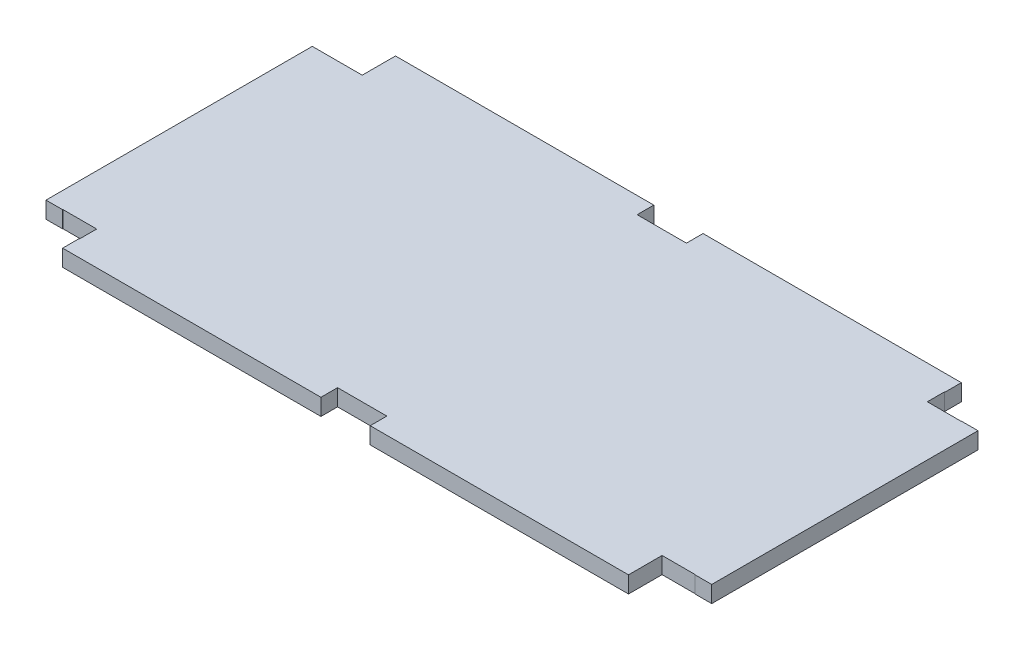
ISO-10303-21;
HEADER;
FILE_DESCRIPTION(('STEP AP214'),'2;1');
FILE_NAME('part.step','',(''),(''),'','','');
FILE_SCHEMA(('AUTOMOTIVE_DESIGN { 1 0 10303 214 1 1 1 1 }'));
ENDSEC;
DATA;
#1=APPLICATION_CONTEXT('core data for automotive mechanical design processes');
#2=APPLICATION_PROTOCOL_DEFINITION('international standard','automotive_design',2000,#1);
#3=PRODUCT_CONTEXT('',#1,'mechanical');
#4=PRODUCT('Part','Part','',(#3));
#5=PRODUCT_RELATED_PRODUCT_CATEGORY('part','',(#4));
#6=PRODUCT_DEFINITION_FORMATION('','',#4);
#7=PRODUCT_DEFINITION_CONTEXT('part definition',#1,'design');
#8=PRODUCT_DEFINITION('design','',#6,#7);
#9=PRODUCT_DEFINITION_SHAPE('','',#8);
#10=(LENGTH_UNIT() NAMED_UNIT(*) SI_UNIT(.MILLI.,.METRE.));
#11=(NAMED_UNIT(*) PLANE_ANGLE_UNIT() SI_UNIT($,.RADIAN.));
#12=(NAMED_UNIT(*) SI_UNIT($,.STERADIAN.) SOLID_ANGLE_UNIT());
#13=UNCERTAINTY_MEASURE_WITH_UNIT(LENGTH_MEASURE(1.E-05),#10,'distance_accuracy_value','');
#14=(GEOMETRIC_REPRESENTATION_CONTEXT(3) GLOBAL_UNCERTAINTY_ASSIGNED_CONTEXT((#13)) GLOBAL_UNIT_ASSIGNED_CONTEXT((#10,
#11,#12)) REPRESENTATION_CONTEXT('',''));
#15=CARTESIAN_POINT('',(0.,0.,0.));
#16=DIRECTION('',(0.,0.,1.));
#17=DIRECTION('',(1.,0.,0.));
#18=AXIS2_PLACEMENT_3D('',#15,#16,#17);
#19=CARTESIAN_POINT('',(0.,6.35,0.));
#20=DIRECTION('',(0.,1.,0.));
#21=DIRECTION('',(0.,0.,1.));
#22=AXIS2_PLACEMENT_3D('',#19,#20,#21);
#23=PLANE('',#22);
#24=DIRECTION('',(-1.,0.,0.));
#25=VECTOR('',#24,1.);
#26=CARTESIAN_POINT('',(127.,6.35,-50.8));
#27=LINE('',#26,#25);
#28=CARTESIAN_POINT('',(127.,6.35,-50.8));
#29=VERTEX_POINT('',#28);
#30=CARTESIAN_POINT('',(120.65,6.35,-50.8));
#31=VERTEX_POINT('',#30);
#32=EDGE_CURVE('E381',#29,#31,#27,.T.);
#33=ORIENTED_EDGE('',*,*,#32,.T.);
#34=DIRECTION('',(0.,0.,1.));
#35=VECTOR('',#34,1.);
#36=CARTESIAN_POINT('',(120.65,6.35,0.));
#37=LINE('',#36,#35);
#38=CARTESIAN_POINT('',(120.65,6.34999999999999,-50.6901986028892));
#39=VERTEX_POINT('',#38);
#40=EDGE_CURVE('E247',#31,#39,#37,.T.);
#41=ORIENTED_EDGE('',*,*,#40,.T.);
#42=DIRECTION('',(-1.,0.,0.));
#43=VECTOR('',#42,1.);
#44=CARTESIAN_POINT('',(0.,6.35,-50.6901986028892));
#45=LINE('',#44,#43);
#46=CARTESIAN_POINT('',(107.773755588125,6.34999999999999,-50.6901986028892));
#47=VERTEX_POINT('',#46);
#48=EDGE_CURVE('E254',#39,#47,#45,.T.);
#49=ORIENTED_EDGE('',*,*,#48,.T.);
#50=DIRECTION('',(0.,0.,-1.));
#51=VECTOR('',#50,1.);
#52=CARTESIAN_POINT('',(107.773755588125,6.35,0.));
#53=LINE('',#52,#51);
#54=CARTESIAN_POINT('',(107.773755588125,6.34999999999999,-57.15));
#55=VERTEX_POINT('',#54);
#56=EDGE_CURVE('E542',#47,#55,#53,.T.);
#57=ORIENTED_EDGE('',*,*,#56,.T.);
#58=DIRECTION('',(1.,0.,0.));
#59=VECTOR('',#58,1.);
#60=CARTESIAN_POINT('',(0.,6.35,-57.15));
#61=LINE('',#60,#59);
#62=CARTESIAN_POINT('',(107.95,6.35,-57.15));
#63=VERTEX_POINT('',#62);
#64=EDGE_CURVE('E546',#55,#63,#61,.T.);
#65=ORIENTED_EDGE('',*,*,#64,.T.);
#66=DIRECTION('',(0.,0.,1.));
#67=VECTOR('',#66,1.);
#68=CARTESIAN_POINT('',(107.95,6.35,-63.5));
#69=LINE('',#68,#67);
#70=CARTESIAN_POINT('',(107.95,6.35,-63.5));
#71=VERTEX_POINT('',#70);
#72=EDGE_CURVE('E376',#71,#63,#69,.T.);
#73=ORIENTED_EDGE('',*,*,#72,.F.);
#74=DIRECTION('',(-1.,0.,0.));
#75=VECTOR('',#74,1.);
#76=CARTESIAN_POINT('',(127.,6.35,-63.5));
#77=LINE('',#76,#75);
#78=CARTESIAN_POINT('',(9.39799999999999,6.35,-63.5));
#79=VERTEX_POINT('',#78);
#80=EDGE_CURVE('E325',#71,#79,#77,.T.);
#81=ORIENTED_EDGE('',*,*,#80,.T.);
#82=DIRECTION('',(0.,0.,1.));
#83=VECTOR('',#82,1.);
#84=CARTESIAN_POINT('',(9.39799999999999,6.35,-63.5));
#85=LINE('',#84,#83);
#86=CARTESIAN_POINT('',(9.39799999999999,6.35,-57.15));
#87=VERTEX_POINT('',#86);
#88=EDGE_CURVE('E406',#79,#87,#85,.T.);
#89=ORIENTED_EDGE('',*,*,#88,.T.);
#90=DIRECTION('',(1.,0.,0.));
#91=VECTOR('',#90,1.);
#92=CARTESIAN_POINT('',(-9.39799999999999,6.35,-57.15));
#93=LINE('',#92,#91);
#94=CARTESIAN_POINT('',(-9.39799999999999,6.35,-57.15));
#95=VERTEX_POINT('',#94);
#96=EDGE_CURVE('E403',#95,#87,#93,.T.);
#97=ORIENTED_EDGE('',*,*,#96,.F.);
#98=DIRECTION('',(0.,0.,1.));
#99=VECTOR('',#98,1.);
#100=CARTESIAN_POINT('',(-9.39799999999999,6.35,-63.5));
#101=LINE('',#100,#99);
#102=CARTESIAN_POINT('',(-9.39799999999999,6.35,-63.5));
#103=VERTEX_POINT('',#102);
#104=EDGE_CURVE('E399',#103,#95,#101,.T.);
#105=ORIENTED_EDGE('',*,*,#104,.F.);
#106=CARTESIAN_POINT('',(-107.95,6.35,-63.5));
#107=VERTEX_POINT('',#106);
#108=EDGE_CURVE('E345',#103,#107,#77,.T.);
#109=ORIENTED_EDGE('',*,*,#108,.T.);
#110=DIRECTION('',(0.,0.,1.));
#111=VECTOR('',#110,1.);
#112=CARTESIAN_POINT('',(-107.95,6.35,-63.5));
#113=LINE('',#112,#111);
#114=CARTESIAN_POINT('',(-107.95,6.34999999999999,-50.8));
#115=VERTEX_POINT('',#114);
#116=EDGE_CURVE('E371',#107,#115,#113,.T.);
#117=ORIENTED_EDGE('',*,*,#116,.T.);
#118=DIRECTION('',(1.,0.,0.));
#119=VECTOR('',#118,1.);
#120=CARTESIAN_POINT('',(-127.,6.35,-50.8));
#121=LINE('',#120,#119);
#122=CARTESIAN_POINT('',(-127.,6.35,-50.8));
#123=VERTEX_POINT('',#122);
#124=EDGE_CURVE('E365',#123,#115,#121,.T.);
#125=ORIENTED_EDGE('',*,*,#124,.F.);
#126=DIRECTION('',(0.,0.,1.));
#127=VECTOR('',#126,1.);
#128=CARTESIAN_POINT('',(-127.,6.35,63.5));
#129=LINE('',#128,#127);
#130=CARTESIAN_POINT('',(-127.,6.35,50.8));
#131=VERTEX_POINT('',#130);
#132=EDGE_CURVE('E358',#123,#131,#129,.T.);
#133=ORIENTED_EDGE('',*,*,#132,.T.);
#134=DIRECTION('',(1.,0.,0.));
#135=VECTOR('',#134,1.);
#136=CARTESIAN_POINT('',(-127.,6.35,50.8));
#137=LINE('',#136,#135);
#138=CARTESIAN_POINT('',(-120.65,6.35,50.8));
#139=VERTEX_POINT('',#138);
#140=EDGE_CURVE('E451',#131,#139,#137,.T.);
#141=ORIENTED_EDGE('',*,*,#140,.T.);
#142=DIRECTION('',(0.,0.,1.));
#143=VECTOR('',#142,1.);
#144=CARTESIAN_POINT('',(-120.65,6.35,0.));
#145=LINE('',#144,#143);
#146=CARTESIAN_POINT('',(-120.65,6.34999999999999,50.6901986028892));
#147=VERTEX_POINT('',#146);
#148=EDGE_CURVE('E509',#147,#139,#145,.T.);
#149=ORIENTED_EDGE('',*,*,#148,.F.);
#150=DIRECTION('',(-1.,0.,0.));
#151=VECTOR('',#150,1.);
#152=CARTESIAN_POINT('',(0.,6.35,50.6901986028892));
#153=LINE('',#152,#151);
#154=CARTESIAN_POINT('',(-107.773755588125,6.34999999999999,50.6901986028892));
#155=VERTEX_POINT('',#154);
#156=EDGE_CURVE('E488',#155,#147,#153,.T.);
#157=ORIENTED_EDGE('',*,*,#156,.F.);
#158=DIRECTION('',(0.,0.,1.));
#159=VECTOR('',#158,1.);
#160=CARTESIAN_POINT('',(-107.773755588125,6.35,0.));
#161=LINE('',#160,#159);
#162=CARTESIAN_POINT('',(-107.773755588125,6.34999999999999,57.15));
#163=VERTEX_POINT('',#162);
#164=EDGE_CURVE('E491',#155,#163,#161,.T.);
#165=ORIENTED_EDGE('',*,*,#164,.T.);
#166=DIRECTION('',(-1.,0.,0.));
#167=VECTOR('',#166,1.);
#168=CARTESIAN_POINT('',(0.,6.35,57.15));
#169=LINE('',#168,#167);
#170=CARTESIAN_POINT('',(-107.95,6.35,57.15));
#171=VERTEX_POINT('',#170);
#172=EDGE_CURVE('E502',#163,#171,#169,.T.);
#173=ORIENTED_EDGE('',*,*,#172,.T.);
#174=DIRECTION('',(0.,0.,-1.));
#175=VECTOR('',#174,1.);
#176=CARTESIAN_POINT('',(-107.95,6.35,63.5));
#177=LINE('',#176,#175);
#178=CARTESIAN_POINT('',(-107.95,6.35,63.5));
#179=VERTEX_POINT('',#178);
#180=EDGE_CURVE('E375',#179,#171,#177,.T.);
#181=ORIENTED_EDGE('',*,*,#180,.F.);
#182=DIRECTION('',(1.,0.,0.));
#183=VECTOR('',#182,1.);
#184=CARTESIAN_POINT('',(127.,6.35,63.5));
#185=LINE('',#184,#183);
#186=CARTESIAN_POINT('',(-9.39799999999999,6.35,63.5));
#187=VERTEX_POINT('',#186);
#188=EDGE_CURVE('E353',#179,#187,#185,.T.);
#189=ORIENTED_EDGE('',*,*,#188,.T.);
#190=DIRECTION('',(0.,0.,-1.));
#191=VECTOR('',#190,1.);
#192=CARTESIAN_POINT('',(-9.39799999999999,6.35,63.5));
#193=LINE('',#192,#191);
#194=CARTESIAN_POINT('',(-9.39799999999999,6.35,57.15));
#195=VERTEX_POINT('',#194);
#196=EDGE_CURVE('E424',#187,#195,#193,.T.);
#197=ORIENTED_EDGE('',*,*,#196,.T.);
#198=DIRECTION('',(1.,0.,0.));
#199=VECTOR('',#198,1.);
#200=CARTESIAN_POINT('',(-9.39799999999999,6.35,57.15));
#201=LINE('',#200,#199);
#202=CARTESIAN_POINT('',(9.39799999999999,6.35,57.15));
#203=VERTEX_POINT('',#202);
#204=EDGE_CURVE('E429',#195,#203,#201,.T.);
#205=ORIENTED_EDGE('',*,*,#204,.T.);
#206=DIRECTION('',(0.,0.,-1.));
#207=VECTOR('',#206,1.);
#208=CARTESIAN_POINT('',(9.39799999999999,6.35,63.5));
#209=LINE('',#208,#207);
#210=CARTESIAN_POINT('',(9.39799999999999,6.35,63.5));
#211=VERTEX_POINT('',#210);
#212=EDGE_CURVE('E433',#211,#203,#209,.T.);
#213=ORIENTED_EDGE('',*,*,#212,.F.);
#214=CARTESIAN_POINT('',(107.95,6.35,63.5));
#215=VERTEX_POINT('',#214);
#216=EDGE_CURVE('E354',#211,#215,#185,.T.);
#217=ORIENTED_EDGE('',*,*,#216,.T.);
#218=DIRECTION('',(0.,0.,-1.));
#219=VECTOR('',#218,1.);
#220=CARTESIAN_POINT('',(107.95,6.35,63.5));
#221=LINE('',#220,#219);
#222=CARTESIAN_POINT('',(107.95,6.34999999999999,50.6901986028892));
#223=VERTEX_POINT('',#222);
#224=EDGE_CURVE('E471',#215,#223,#221,.T.);
#225=ORIENTED_EDGE('',*,*,#224,.T.);
#226=DIRECTION('',(1.,0.,0.));
#227=VECTOR('',#226,1.);
#228=CARTESIAN_POINT('',(0.,6.35,50.6901986028892));
#229=LINE('',#228,#227);
#230=CARTESIAN_POINT('',(120.65,6.34999999999999,50.6901986028892));
#231=VERTEX_POINT('',#230);
#232=EDGE_CURVE('E484',#223,#231,#229,.T.);
#233=ORIENTED_EDGE('',*,*,#232,.T.);
#234=DIRECTION('',(0.,0.,1.));
#235=VECTOR('',#234,1.);
#236=CARTESIAN_POINT('',(120.65,6.35,0.));
#237=LINE('',#236,#235);
#238=CARTESIAN_POINT('',(120.65,6.35,50.8));
#239=VERTEX_POINT('',#238);
#240=EDGE_CURVE('E495',#231,#239,#237,.T.);
#241=ORIENTED_EDGE('',*,*,#240,.T.);
#242=DIRECTION('',(-1.,0.,0.));
#243=VECTOR('',#242,1.);
#244=CARTESIAN_POINT('',(127.,6.35,50.8));
#245=LINE('',#244,#243);
#246=CARTESIAN_POINT('',(127.,6.35,50.8));
#247=VERTEX_POINT('',#246);
#248=EDGE_CURVE('E398',#247,#239,#245,.T.);
#249=ORIENTED_EDGE('',*,*,#248,.F.);
#250=DIRECTION('',(0.,0.,-1.));
#251=VECTOR('',#250,1.);
#252=CARTESIAN_POINT('',(127.,6.35,63.5));
#253=LINE('',#252,#251);
#254=EDGE_CURVE('E349',#247,#29,#253,.T.);
#255=ORIENTED_EDGE('',*,*,#254,.T.);
#256=EDGE_LOOP('',(#33,#41,#49,#57,#65,#73,#81,#89,#97,#105,#109,#117,#125,#133,#141,#149,#157,
#165,#173,#181,#189,#197,#205,#213,#217,#225,#233,#241,#249,#255));
#257=FACE_BOUND('',#256,.T.);
#258=ADVANCED_FACE('F38',(#257),#23,.T.);
#259=CARTESIAN_POINT('',(0.,0.,0.));
#260=DIRECTION('',(0.,1.,0.));
#261=DIRECTION('',(0.,0.,1.));
#262=AXIS2_PLACEMENT_3D('',#259,#260,#261);
#263=PLANE('',#262);
#264=DIRECTION('',(0.,0.,1.));
#265=VECTOR('',#264,1.);
#266=CARTESIAN_POINT('',(120.65,0.,0.));
#267=LINE('',#266,#265);
#268=CARTESIAN_POINT('',(120.65,0.,-50.8));
#269=VERTEX_POINT('',#268);
#270=CARTESIAN_POINT('',(120.65,0.,-50.6901986028892));
#271=VERTEX_POINT('',#270);
#272=EDGE_CURVE('E235',#269,#271,#267,.T.);
#273=ORIENTED_EDGE('',*,*,#272,.F.);
#274=DIRECTION('',(1.,0.,0.));
#275=VECTOR('',#274,1.);
#276=CARTESIAN_POINT('',(0.,0.,-50.8));
#277=LINE('',#276,#275);
#278=CARTESIAN_POINT('',(127.,0.,-50.8));
#279=VERTEX_POINT('',#278);
#280=EDGE_CURVE('E309',#269,#279,#277,.T.);
#281=ORIENTED_EDGE('',*,*,#280,.T.);
#282=DIRECTION('',(0.,0.,-1.));
#283=VECTOR('',#282,1.);
#284=CARTESIAN_POINT('',(127.,0.,63.5));
#285=LINE('',#284,#283);
#286=CARTESIAN_POINT('',(127.,0.,50.8));
#287=VERTEX_POINT('',#286);
#288=EDGE_CURVE('E331',#287,#279,#285,.T.);
#289=ORIENTED_EDGE('',*,*,#288,.F.);
#290=DIRECTION('',(1.,0.,0.));
#291=VECTOR('',#290,1.);
#292=CARTESIAN_POINT('',(0.,0.,50.8));
#293=LINE('',#292,#291);
#294=CARTESIAN_POINT('',(120.65,0.,50.8));
#295=VERTEX_POINT('',#294);
#296=EDGE_CURVE('E312',#295,#287,#293,.T.);
#297=ORIENTED_EDGE('',*,*,#296,.F.);
#298=DIRECTION('',(0.,0.,1.));
#299=VECTOR('',#298,1.);
#300=CARTESIAN_POINT('',(120.65,0.,0.));
#301=LINE('',#300,#299);
#302=CARTESIAN_POINT('',(120.65,0.,50.6901986028892));
#303=VERTEX_POINT('',#302);
#304=EDGE_CURVE('E499',#303,#295,#301,.T.);
#305=ORIENTED_EDGE('',*,*,#304,.F.);
#306=DIRECTION('',(1.,0.,0.));
#307=VECTOR('',#306,1.);
#308=CARTESIAN_POINT('',(0.,0.,50.6901986028892));
#309=LINE('',#308,#307);
#310=CARTESIAN_POINT('',(107.95,0.,50.6901986028892));
#311=VERTEX_POINT('',#310);
#312=EDGE_CURVE('E267',#311,#303,#309,.T.);
#313=ORIENTED_EDGE('',*,*,#312,.F.);
#314=DIRECTION('',(0.,0.,1.));
#315=VECTOR('',#314,1.);
#316=CARTESIAN_POINT('',(107.95,0.,0.));
#317=LINE('',#316,#315);
#318=CARTESIAN_POINT('',(107.95,0.,63.5));
#319=VERTEX_POINT('',#318);
#320=EDGE_CURVE('E315',#311,#319,#317,.T.);
#321=ORIENTED_EDGE('',*,*,#320,.T.);
#322=DIRECTION('',(1.,0.,0.));
#323=VECTOR('',#322,1.);
#324=CARTESIAN_POINT('',(127.,0.,63.5));
#325=LINE('',#324,#323);
#326=CARTESIAN_POINT('',(9.39799999999999,0.,63.5));
#327=VERTEX_POINT('',#326);
#328=EDGE_CURVE('E336',#327,#319,#325,.T.);
#329=ORIENTED_EDGE('',*,*,#328,.F.);
#330=DIRECTION('',(0.,0.,1.));
#331=VECTOR('',#330,1.);
#332=CARTESIAN_POINT('',(9.39799999999999,0.,0.));
#333=LINE('',#332,#331);
#334=CARTESIAN_POINT('',(9.39799999999999,0.,57.15));
#335=VERTEX_POINT('',#334);
#336=EDGE_CURVE('E289',#335,#327,#333,.T.);
#337=ORIENTED_EDGE('',*,*,#336,.F.);
#338=DIRECTION('',(-1.,0.,0.));
#339=VECTOR('',#338,1.);
#340=CARTESIAN_POINT('',(0.,0.,57.15));
#341=LINE('',#340,#339);
#342=CARTESIAN_POINT('',(-9.39799999999999,0.,57.15));
#343=VERTEX_POINT('',#342);
#344=EDGE_CURVE('E292',#335,#343,#341,.T.);
#345=ORIENTED_EDGE('',*,*,#344,.T.);
#346=DIRECTION('',(0.,0.,1.));
#347=VECTOR('',#346,1.);
#348=CARTESIAN_POINT('',(-9.39799999999999,0.,0.));
#349=LINE('',#348,#347);
#350=CARTESIAN_POINT('',(-9.39799999999999,0.,63.5));
#351=VERTEX_POINT('',#350);
#352=EDGE_CURVE('E285',#343,#351,#349,.T.);
#353=ORIENTED_EDGE('',*,*,#352,.T.);
#354=CARTESIAN_POINT('',(-107.95,0.,63.5));
#355=VERTEX_POINT('',#354);
#356=EDGE_CURVE('E335',#355,#351,#325,.T.);
#357=ORIENTED_EDGE('',*,*,#356,.F.);
#358=DIRECTION('',(0.,0.,1.));
#359=VECTOR('',#358,1.);
#360=CARTESIAN_POINT('',(-107.95,0.,0.));
#361=LINE('',#360,#359);
#362=CARTESIAN_POINT('',(-107.95,0.,57.15));
#363=VERTEX_POINT('',#362);
#364=EDGE_CURVE('E278',#363,#355,#361,.T.);
#365=ORIENTED_EDGE('',*,*,#364,.F.);
#366=DIRECTION('',(-1.,0.,0.));
#367=VECTOR('',#366,1.);
#368=CARTESIAN_POINT('',(0.,0.,57.15));
#369=LINE('',#368,#367);
#370=CARTESIAN_POINT('',(-107.773755588125,0.,57.15));
#371=VERTEX_POINT('',#370);
#372=EDGE_CURVE('E506',#371,#363,#369,.T.);
#373=ORIENTED_EDGE('',*,*,#372,.F.);
#374=DIRECTION('',(0.,0.,1.));
#375=VECTOR('',#374,1.);
#376=CARTESIAN_POINT('',(-107.773755588125,0.,0.));
#377=LINE('',#376,#375);
#378=CARTESIAN_POINT('',(-107.773755588125,0.,50.6901986028892));
#379=VERTEX_POINT('',#378);
#380=EDGE_CURVE('E275',#379,#371,#377,.T.);
#381=ORIENTED_EDGE('',*,*,#380,.F.);
#382=DIRECTION('',(-1.,0.,0.));
#383=VECTOR('',#382,1.);
#384=CARTESIAN_POINT('',(0.,0.,50.6901986028892));
#385=LINE('',#384,#383);
#386=CARTESIAN_POINT('',(-120.65,0.,50.6901986028892));
#387=VERTEX_POINT('',#386);
#388=EDGE_CURVE('E269',#379,#387,#385,.T.);
#389=ORIENTED_EDGE('',*,*,#388,.T.);
#390=DIRECTION('',(0.,0.,1.));
#391=VECTOR('',#390,1.);
#392=CARTESIAN_POINT('',(-120.65,0.,0.));
#393=LINE('',#392,#391);
#394=CARTESIAN_POINT('',(-120.65,0.,50.8));
#395=VERTEX_POINT('',#394);
#396=EDGE_CURVE('E512',#387,#395,#393,.T.);
#397=ORIENTED_EDGE('',*,*,#396,.T.);
#398=DIRECTION('',(-1.,0.,0.));
#399=VECTOR('',#398,1.);
#400=CARTESIAN_POINT('',(0.,0.,50.8));
#401=LINE('',#400,#399);
#402=CARTESIAN_POINT('',(-127.,0.,50.8));
#403=VERTEX_POINT('',#402);
#404=EDGE_CURVE('E281',#395,#403,#401,.T.);
#405=ORIENTED_EDGE('',*,*,#404,.T.);
#406=DIRECTION('',(0.,0.,1.));
#407=VECTOR('',#406,1.);
#408=CARTESIAN_POINT('',(-127.,0.,63.5));
#409=LINE('',#408,#407);
#410=CARTESIAN_POINT('',(-127.,0.,-50.8));
#411=VERTEX_POINT('',#410);
#412=EDGE_CURVE('E340',#411,#403,#409,.T.);
#413=ORIENTED_EDGE('',*,*,#412,.F.);
#414=DIRECTION('',(-1.,0.,0.));
#415=VECTOR('',#414,1.);
#416=CARTESIAN_POINT('',(0.,0.,-50.8));
#417=LINE('',#416,#415);
#418=CARTESIAN_POINT('',(-107.95,0.,-50.8));
#419=VERTEX_POINT('',#418);
#420=EDGE_CURVE('E318',#419,#411,#417,.T.);
#421=ORIENTED_EDGE('',*,*,#420,.F.);
#422=DIRECTION('',(0.,0.,-1.));
#423=VECTOR('',#422,1.);
#424=CARTESIAN_POINT('',(-107.95,0.,0.));
#425=LINE('',#424,#423);
#426=CARTESIAN_POINT('',(-107.95,0.,-63.5));
#427=VERTEX_POINT('',#426);
#428=EDGE_CURVE('E321',#419,#427,#425,.T.);
#429=ORIENTED_EDGE('',*,*,#428,.T.);
#430=DIRECTION('',(-1.,0.,0.));
#431=VECTOR('',#430,1.);
#432=CARTESIAN_POINT('',(127.,0.,-63.5));
#433=LINE('',#432,#431);
#434=CARTESIAN_POINT('',(-9.39799999999999,0.,-63.5));
#435=VERTEX_POINT('',#434);
#436=EDGE_CURVE('E326',#435,#427,#433,.T.);
#437=ORIENTED_EDGE('',*,*,#436,.F.);
#438=DIRECTION('',(0.,0.,-1.));
#439=VECTOR('',#438,1.);
#440=CARTESIAN_POINT('',(-9.39799999999999,0.,0.));
#441=LINE('',#440,#439);
#442=CARTESIAN_POINT('',(-9.39799999999999,0.,-57.15));
#443=VERTEX_POINT('',#442);
#444=EDGE_CURVE('E296',#443,#435,#441,.T.);
#445=ORIENTED_EDGE('',*,*,#444,.F.);
#446=DIRECTION('',(-1.,0.,0.));
#447=VECTOR('',#446,1.);
#448=CARTESIAN_POINT('',(0.,0.,-57.15));
#449=LINE('',#448,#447);
#450=CARTESIAN_POINT('',(9.39799999999999,0.,-57.15));
#451=VERTEX_POINT('',#450);
#452=EDGE_CURVE('E299',#451,#443,#449,.T.);
#453=ORIENTED_EDGE('',*,*,#452,.F.);
#454=DIRECTION('',(0.,0.,-1.));
#455=VECTOR('',#454,1.);
#456=CARTESIAN_POINT('',(9.39799999999999,0.,0.));
#457=LINE('',#456,#455);
#458=CARTESIAN_POINT('',(9.39799999999999,0.,-63.5));
#459=VERTEX_POINT('',#458);
#460=EDGE_CURVE('E302',#451,#459,#457,.T.);
#461=ORIENTED_EDGE('',*,*,#460,.T.);
#462=CARTESIAN_POINT('',(107.95,0.,-63.5));
#463=VERTEX_POINT('',#462);
#464=EDGE_CURVE('E330',#463,#459,#433,.T.);
#465=ORIENTED_EDGE('',*,*,#464,.F.);
#466=DIRECTION('',(0.,0.,-1.));
#467=VECTOR('',#466,1.);
#468=CARTESIAN_POINT('',(107.95,0.,0.));
#469=LINE('',#468,#467);
#470=CARTESIAN_POINT('',(107.95,0.,-57.15));
#471=VERTEX_POINT('',#470);
#472=EDGE_CURVE('E306',#471,#463,#469,.T.);
#473=ORIENTED_EDGE('',*,*,#472,.F.);
#474=DIRECTION('',(1.,0.,0.));
#475=VECTOR('',#474,1.);
#476=CARTESIAN_POINT('',(0.,0.,-57.15));
#477=LINE('',#476,#475);
#478=CARTESIAN_POINT('',(107.773755588125,0.,-57.15));
#479=VERTEX_POINT('',#478);
#480=EDGE_CURVE('E262',#479,#471,#477,.T.);
#481=ORIENTED_EDGE('',*,*,#480,.F.);
#482=DIRECTION('',(0.,0.,-1.));
#483=VECTOR('',#482,1.);
#484=CARTESIAN_POINT('',(107.773755588125,0.,0.));
#485=LINE('',#484,#483);
#486=CARTESIAN_POINT('',(107.773755588125,0.,-50.6901986028892));
#487=VERTEX_POINT('',#486);
#488=EDGE_CURVE('E47',#487,#479,#485,.T.);
#489=ORIENTED_EDGE('',*,*,#488,.F.);
#490=DIRECTION('',(-1.,0.,0.));
#491=VECTOR('',#490,1.);
#492=CARTESIAN_POINT('',(0.,0.,-50.6901986028892));
#493=LINE('',#492,#491);
#494=EDGE_CURVE('E11',#271,#487,#493,.T.);
#495=ORIENTED_EDGE('',*,*,#494,.F.);
#496=EDGE_LOOP('',(#273,#281,#289,#297,#305,#313,#321,#329,#337,#345,#353,#357,#365,#373,#381,
#389,#397,#405,#413,#421,#429,#437,#445,#453,#461,#465,#473,#481,#489,#495));
#497=FACE_BOUND('',#496,.T.);
#498=ADVANCED_FACE('F259',(#497),#263,.F.);
#499=CARTESIAN_POINT('',(-127.,6.35,63.5));
#500=DIRECTION('',(1.,0.,0.));
#501=DIRECTION('',(0.,0.,-1.));
#502=AXIS2_PLACEMENT_3D('',#499,#500,#501);
#503=PLANE('',#502);
#504=ORIENTED_EDGE('',*,*,#412,.T.);
#505=DIRECTION('',(0.,-1.,0.));
#506=VECTOR('',#505,1.);
#507=CARTESIAN_POINT('',(-127.,6.35,50.8));
#508=LINE('',#507,#506);
#509=EDGE_CURVE('E455',#131,#403,#508,.T.);
#510=ORIENTED_EDGE('',*,*,#509,.F.);
#511=ORIENTED_EDGE('',*,*,#132,.F.);
#512=DIRECTION('',(0.,-1.,0.));
#513=VECTOR('',#512,1.);
#514=CARTESIAN_POINT('',(-127.,6.35,-50.8));
#515=LINE('',#514,#513);
#516=EDGE_CURVE('E344',#123,#411,#515,.T.);
#517=ORIENTED_EDGE('',*,*,#516,.T.);
#518=EDGE_LOOP('',(#504,#510,#511,#517));
#519=FACE_BOUND('',#518,.T.);
#520=ADVANCED_FACE('F40',(#519),#503,.F.);
#521=CARTESIAN_POINT('',(127.,6.35,63.5));
#522=DIRECTION('',(0.,0.,-1.));
#523=DIRECTION('',(-1.,0.,0.));
#524=AXIS2_PLACEMENT_3D('',#521,#522,#523);
#525=PLANE('',#524);
#526=DIRECTION('',(0.,-1.,0.));
#527=VECTOR('',#526,1.);
#528=CARTESIAN_POINT('',(-107.95,6.35,63.5));
#529=LINE('',#528,#527);
#530=EDGE_CURVE('E428',#179,#355,#529,.T.);
#531=ORIENTED_EDGE('',*,*,#530,.T.);
#532=ORIENTED_EDGE('',*,*,#356,.T.);
#533=DIRECTION('',(0.,-1.,0.));
#534=VECTOR('',#533,1.);
#535=CARTESIAN_POINT('',(-9.39799999999999,6.35,63.5));
#536=LINE('',#535,#534);
#537=EDGE_CURVE('E402',#187,#351,#536,.T.);
#538=ORIENTED_EDGE('',*,*,#537,.F.);
#539=ORIENTED_EDGE('',*,*,#188,.F.);
#540=EDGE_LOOP('',(#531,#532,#538,#539));
#541=FACE_BOUND('',#540,.T.);
#542=ADVANCED_FACE('F599',(#541),#525,.F.);
#543=DIRECTION('',(0.,-1.,0.));
#544=VECTOR('',#543,1.);
#545=CARTESIAN_POINT('',(9.39799999999999,6.35,63.5));
#546=LINE('',#545,#544);
#547=EDGE_CURVE('E438',#211,#327,#546,.T.);
#548=ORIENTED_EDGE('',*,*,#547,.T.);
#549=ORIENTED_EDGE('',*,*,#328,.T.);
#550=DIRECTION('',(0.,-1.,0.));
#551=VECTOR('',#550,1.);
#552=CARTESIAN_POINT('',(107.95,6.35,63.5));
#553=LINE('',#552,#551);
#554=EDGE_CURVE('E62',#215,#319,#553,.T.);
#555=ORIENTED_EDGE('',*,*,#554,.F.);
#556=ORIENTED_EDGE('',*,*,#216,.F.);
#557=EDGE_LOOP('',(#548,#549,#555,#556));
#558=FACE_BOUND('',#557,.T.);
#559=ADVANCED_FACE('F585',(#558),#525,.F.);
#560=CARTESIAN_POINT('',(127.,6.35,63.5));
#561=DIRECTION('',(-1.,0.,0.));
#562=DIRECTION('',(0.,0.,1.));
#563=AXIS2_PLACEMENT_3D('',#560,#561,#562);
#564=PLANE('',#563);
#565=ORIENTED_EDGE('',*,*,#288,.T.);
#566=DIRECTION('',(0.,-1.,0.));
#567=VECTOR('',#566,1.);
#568=CARTESIAN_POINT('',(127.,6.35,-50.8));
#569=LINE('',#568,#567);
#570=EDGE_CURVE('E385',#29,#279,#569,.T.);
#571=ORIENTED_EDGE('',*,*,#570,.F.);
#572=ORIENTED_EDGE('',*,*,#254,.F.);
#573=DIRECTION('',(0.,-1.,0.));
#574=VECTOR('',#573,1.);
#575=CARTESIAN_POINT('',(127.,6.35,50.8));
#576=LINE('',#575,#574);
#577=EDGE_CURVE('E480',#247,#287,#576,.T.);
#578=ORIENTED_EDGE('',*,*,#577,.T.);
#579=EDGE_LOOP('',(#565,#571,#572,#578));
#580=FACE_BOUND('',#579,.T.);
#581=ADVANCED_FACE('F568',(#580),#564,.F.);
#582=CARTESIAN_POINT('',(127.,6.35,-63.5));
#583=DIRECTION('',(0.,0.,1.));
#584=DIRECTION('',(1.,0.,0.));
#585=AXIS2_PLACEMENT_3D('',#582,#583,#584);
#586=PLANE('',#585);
#587=DIRECTION('',(0.,-1.,0.));
#588=VECTOR('',#587,1.);
#589=CARTESIAN_POINT('',(-9.39799999999999,6.35,-63.5));
#590=LINE('',#589,#588);
#591=EDGE_CURVE('E410',#103,#435,#590,.T.);
#592=ORIENTED_EDGE('',*,*,#591,.T.);
#593=ORIENTED_EDGE('',*,*,#436,.T.);
#594=DIRECTION('',(0.,-1.,0.));
#595=VECTOR('',#594,1.);
#596=CARTESIAN_POINT('',(-107.95,6.35,-63.5));
#597=LINE('',#596,#595);
#598=EDGE_CURVE('E362',#107,#427,#597,.T.);
#599=ORIENTED_EDGE('',*,*,#598,.F.);
#600=ORIENTED_EDGE('',*,*,#108,.F.);
#601=EDGE_LOOP('',(#592,#593,#599,#600));
#602=FACE_BOUND('',#601,.T.);
#603=ADVANCED_FACE('F628',(#602),#586,.F.);
#604=ORIENTED_EDGE('',*,*,#464,.T.);
#605=DIRECTION('',(0.,-1.,0.));
#606=VECTOR('',#605,1.);
#607=CARTESIAN_POINT('',(9.39799999999999,6.35,-63.5));
#608=LINE('',#607,#606);
#609=EDGE_CURVE('E414',#79,#459,#608,.T.);
#610=ORIENTED_EDGE('',*,*,#609,.F.);
#611=ORIENTED_EDGE('',*,*,#80,.F.);
#612=DIRECTION('',(0.,-1.,0.));
#613=VECTOR('',#612,1.);
#614=CARTESIAN_POINT('',(107.95,6.35,-63.5));
#615=LINE('',#614,#613);
#616=EDGE_CURVE('E394',#71,#463,#615,.T.);
#617=ORIENTED_EDGE('',*,*,#616,.T.);
#618=EDGE_LOOP('',(#604,#610,#611,#617));
#619=FACE_BOUND('',#618,.T.);
#620=ADVANCED_FACE('F611',(#619),#586,.F.);
#621=CARTESIAN_POINT('',(-127.,6.35,-50.8));
#622=DIRECTION('',(0.,0.,-1.));
#623=DIRECTION('',(-1.,0.,0.));
#624=AXIS2_PLACEMENT_3D('',#621,#622,#623);
#625=PLANE('',#624);
#626=ORIENTED_EDGE('',*,*,#420,.T.);
#627=ORIENTED_EDGE('',*,*,#516,.F.);
#628=ORIENTED_EDGE('',*,*,#124,.T.);
#629=DIRECTION('',(0.,-1.,0.));
#630=VECTOR('',#629,1.);
#631=CARTESIAN_POINT('',(-107.95,127.,-50.8));
#632=LINE('',#631,#630);
#633=EDGE_CURVE('E529',#115,#419,#632,.T.);
#634=ORIENTED_EDGE('',*,*,#633,.T.);
#635=EDGE_LOOP('',(#626,#627,#628,#634));
#636=FACE_BOUND('',#635,.T.);
#637=ADVANCED_FACE('F635',(#636),#625,.T.);
#638=CARTESIAN_POINT('',(-107.95,6.35,-63.5));
#639=DIRECTION('',(1.,0.,0.));
#640=DIRECTION('',(0.,0.,-1.));
#641=AXIS2_PLACEMENT_3D('',#638,#639,#640);
#642=PLANE('',#641);
#643=ORIENTED_EDGE('',*,*,#428,.F.);
#644=ORIENTED_EDGE('',*,*,#633,.F.);
#645=ORIENTED_EDGE('',*,*,#116,.F.);
#646=ORIENTED_EDGE('',*,*,#598,.T.);
#647=EDGE_LOOP('',(#643,#644,#645,#646));
#648=FACE_BOUND('',#647,.T.);
#649=ADVANCED_FACE('F631',(#648),#642,.F.);
#650=CARTESIAN_POINT('',(127.,6.35,50.8));
#651=DIRECTION('',(0.,0.,1.));
#652=DIRECTION('',(1.,0.,0.));
#653=AXIS2_PLACEMENT_3D('',#650,#651,#652);
#654=PLANE('',#653);
#655=ORIENTED_EDGE('',*,*,#296,.T.);
#656=ORIENTED_EDGE('',*,*,#577,.F.);
#657=ORIENTED_EDGE('',*,*,#248,.T.);
#658=DIRECTION('',(0.,-1.,0.));
#659=VECTOR('',#658,1.);
#660=CARTESIAN_POINT('',(120.65,6.35,50.8));
#661=LINE('',#660,#659);
#662=EDGE_CURVE('E476',#239,#295,#661,.T.);
#663=ORIENTED_EDGE('',*,*,#662,.T.);
#664=EDGE_LOOP('',(#655,#656,#657,#663));
#665=FACE_BOUND('',#664,.T.);
#666=ADVANCED_FACE('F572',(#665),#654,.T.);
#667=CARTESIAN_POINT('',(107.95,6.35,63.5));
#668=DIRECTION('',(-1.,0.,0.));
#669=DIRECTION('',(0.,0.,1.));
#670=AXIS2_PLACEMENT_3D('',#667,#668,#669);
#671=PLANE('',#670);
#672=ORIENTED_EDGE('',*,*,#320,.F.);
#673=DIRECTION('',(0.,-1.,0.));
#674=VECTOR('',#673,1.);
#675=CARTESIAN_POINT('',(107.95,127.,50.6901986028892));
#676=LINE('',#675,#674);
#677=EDGE_CURVE('E533',#223,#311,#676,.T.);
#678=ORIENTED_EDGE('',*,*,#677,.F.);
#679=ORIENTED_EDGE('',*,*,#224,.F.);
#680=ORIENTED_EDGE('',*,*,#554,.T.);
#681=EDGE_LOOP('',(#672,#678,#679,#680));
#682=FACE_BOUND('',#681,.T.);
#683=ADVANCED_FACE('F722',(#682),#671,.F.);
#684=CARTESIAN_POINT('',(107.95,6.35,-63.5));
#685=DIRECTION('',(1.,0.,0.));
#686=DIRECTION('',(0.,0.,-1.));
#687=AXIS2_PLACEMENT_3D('',#684,#685,#686);
#688=PLANE('',#687);
#689=ORIENTED_EDGE('',*,*,#472,.T.);
#690=ORIENTED_EDGE('',*,*,#616,.F.);
#691=ORIENTED_EDGE('',*,*,#72,.T.);
#692=DIRECTION('',(0.,-1.,0.));
#693=VECTOR('',#692,1.);
#694=CARTESIAN_POINT('',(107.95,6.35,-57.15));
#695=LINE('',#694,#693);
#696=EDGE_CURVE('E390',#63,#471,#695,.T.);
#697=ORIENTED_EDGE('',*,*,#696,.T.);
#698=EDGE_LOOP('',(#689,#690,#691,#697));
#699=FACE_BOUND('',#698,.T.);
#700=ADVANCED_FACE('F730',(#699),#688,.T.);
#701=CARTESIAN_POINT('',(127.,6.35,-50.8));
#702=DIRECTION('',(0.,0.,1.));
#703=DIRECTION('',(1.,0.,0.));
#704=AXIS2_PLACEMENT_3D('',#701,#702,#703);
#705=PLANE('',#704);
#706=DIRECTION('',(0.,-1.,0.));
#707=VECTOR('',#706,1.);
#708=CARTESIAN_POINT('',(120.65,6.35,-50.8));
#709=LINE('',#708,#707);
#710=EDGE_CURVE('E241',#31,#269,#709,.T.);
#711=ORIENTED_EDGE('',*,*,#710,.F.);
#712=ORIENTED_EDGE('',*,*,#32,.F.);
#713=ORIENTED_EDGE('',*,*,#570,.T.);
#714=ORIENTED_EDGE('',*,*,#280,.F.);
#715=EDGE_LOOP('',(#711,#712,#713,#714));
#716=FACE_BOUND('',#715,.T.);
#717=ADVANCED_FACE('F563',(#716),#705,.F.);
#718=CARTESIAN_POINT('',(-9.39799999999999,6.35,-63.5));
#719=DIRECTION('',(1.,0.,0.));
#720=DIRECTION('',(0.,0.,-1.));
#721=AXIS2_PLACEMENT_3D('',#718,#719,#720);
#722=PLANE('',#721);
#723=ORIENTED_EDGE('',*,*,#444,.T.);
#724=ORIENTED_EDGE('',*,*,#591,.F.);
#725=ORIENTED_EDGE('',*,*,#104,.T.);
#726=DIRECTION('',(0.,-1.,0.));
#727=VECTOR('',#726,1.);
#728=CARTESIAN_POINT('',(-9.39799999999999,6.35,-57.15));
#729=LINE('',#728,#727);
#730=EDGE_CURVE('E380',#95,#443,#729,.T.);
#731=ORIENTED_EDGE('',*,*,#730,.T.);
#732=EDGE_LOOP('',(#723,#724,#725,#731));
#733=FACE_BOUND('',#732,.T.);
#734=ADVANCED_FACE('F623',(#733),#722,.T.);
#735=CARTESIAN_POINT('',(-9.39799999999999,6.35,-57.15));
#736=DIRECTION('',(0.,0.,-1.));
#737=DIRECTION('',(-1.,0.,0.));
#738=AXIS2_PLACEMENT_3D('',#735,#736,#737);
#739=PLANE('',#738);
#740=ORIENTED_EDGE('',*,*,#452,.T.);
#741=ORIENTED_EDGE('',*,*,#730,.F.);
#742=ORIENTED_EDGE('',*,*,#96,.T.);
#743=DIRECTION('',(0.,-1.,0.));
#744=VECTOR('',#743,1.);
#745=CARTESIAN_POINT('',(9.39799999999999,6.35,-57.15));
#746=LINE('',#745,#744);
#747=EDGE_CURVE('E417',#87,#451,#746,.T.);
#748=ORIENTED_EDGE('',*,*,#747,.T.);
#749=EDGE_LOOP('',(#740,#741,#742,#748));
#750=FACE_BOUND('',#749,.T.);
#751=ADVANCED_FACE('F621',(#750),#739,.T.);
#752=CARTESIAN_POINT('',(9.39799999999999,6.35,-63.5));
#753=DIRECTION('',(1.,0.,0.));
#754=DIRECTION('',(0.,0.,-1.));
#755=AXIS2_PLACEMENT_3D('',#752,#753,#754);
#756=PLANE('',#755);
#757=ORIENTED_EDGE('',*,*,#747,.F.);
#758=ORIENTED_EDGE('',*,*,#88,.F.);
#759=ORIENTED_EDGE('',*,*,#609,.T.);
#760=ORIENTED_EDGE('',*,*,#460,.F.);
#761=EDGE_LOOP('',(#757,#758,#759,#760));
#762=FACE_BOUND('',#761,.T.);
#763=ADVANCED_FACE('F615',(#762),#756,.F.);
#764=CARTESIAN_POINT('',(-9.39799999999999,6.35,63.5));
#765=DIRECTION('',(-1.,0.,0.));
#766=DIRECTION('',(0.,0.,1.));
#767=AXIS2_PLACEMENT_3D('',#764,#765,#766);
#768=PLANE('',#767);
#769=DIRECTION('',(0.,-1.,0.));
#770=VECTOR('',#769,1.);
#771=CARTESIAN_POINT('',(-9.39799999999999,6.35,57.15));
#772=LINE('',#771,#770);
#773=EDGE_CURVE('E54',#195,#343,#772,.T.);
#774=ORIENTED_EDGE('',*,*,#773,.F.);
#775=ORIENTED_EDGE('',*,*,#196,.F.);
#776=ORIENTED_EDGE('',*,*,#537,.T.);
#777=ORIENTED_EDGE('',*,*,#352,.F.);
#778=EDGE_LOOP('',(#774,#775,#776,#777));
#779=FACE_BOUND('',#778,.T.);
#780=ADVANCED_FACE('F770',(#779),#768,.F.);
#781=CARTESIAN_POINT('',(9.39799999999999,6.35,63.5));
#782=DIRECTION('',(-1.,0.,0.));
#783=DIRECTION('',(0.,0.,1.));
#784=AXIS2_PLACEMENT_3D('',#781,#782,#783);
#785=PLANE('',#784);
#786=ORIENTED_EDGE('',*,*,#336,.T.);
#787=ORIENTED_EDGE('',*,*,#547,.F.);
#788=ORIENTED_EDGE('',*,*,#212,.T.);
#789=DIRECTION('',(0.,-1.,0.));
#790=VECTOR('',#789,1.);
#791=CARTESIAN_POINT('',(9.39799999999999,6.35,57.15));
#792=LINE('',#791,#790);
#793=EDGE_CURVE('E442',#203,#335,#792,.T.);
#794=ORIENTED_EDGE('',*,*,#793,.T.);
#795=EDGE_LOOP('',(#786,#787,#788,#794));
#796=FACE_BOUND('',#795,.T.);
#797=ADVANCED_FACE('F589',(#796),#785,.T.);
#798=CARTESIAN_POINT('',(-9.39799999999999,6.35,57.15));
#799=DIRECTION('',(0.,0.,-1.));
#800=DIRECTION('',(-1.,0.,0.));
#801=AXIS2_PLACEMENT_3D('',#798,#799,#800);
#802=PLANE('',#801);
#803=ORIENTED_EDGE('',*,*,#793,.F.);
#804=ORIENTED_EDGE('',*,*,#204,.F.);
#805=ORIENTED_EDGE('',*,*,#773,.T.);
#806=ORIENTED_EDGE('',*,*,#344,.F.);
#807=EDGE_LOOP('',(#803,#804,#805,#806));
#808=FACE_BOUND('',#807,.T.);
#809=ADVANCED_FACE('F592',(#808),#802,.F.);
#810=CARTESIAN_POINT('',(-107.95,6.35,63.5));
#811=DIRECTION('',(-1.,0.,0.));
#812=DIRECTION('',(0.,0.,1.));
#813=AXIS2_PLACEMENT_3D('',#810,#811,#812);
#814=PLANE('',#813);
#815=ORIENTED_EDGE('',*,*,#364,.T.);
#816=ORIENTED_EDGE('',*,*,#530,.F.);
#817=ORIENTED_EDGE('',*,*,#180,.T.);
#818=DIRECTION('',(0.,-1.,0.));
#819=VECTOR('',#818,1.);
#820=CARTESIAN_POINT('',(-107.95,6.35,57.15));
#821=LINE('',#820,#819);
#822=EDGE_CURVE('E461',#171,#363,#821,.T.);
#823=ORIENTED_EDGE('',*,*,#822,.T.);
#824=EDGE_LOOP('',(#815,#816,#817,#823));
#825=FACE_BOUND('',#824,.T.);
#826=ADVANCED_FACE('F660',(#825),#814,.T.);
#827=CARTESIAN_POINT('',(-127.,6.35,50.8));
#828=DIRECTION('',(0.,0.,-1.));
#829=DIRECTION('',(-1.,0.,0.));
#830=AXIS2_PLACEMENT_3D('',#827,#828,#829);
#831=PLANE('',#830);
#832=DIRECTION('',(0.,-1.,0.));
#833=VECTOR('',#832,1.);
#834=CARTESIAN_POINT('',(-120.65,6.35,50.8));
#835=LINE('',#834,#833);
#836=EDGE_CURVE('E458',#139,#395,#835,.T.);
#837=ORIENTED_EDGE('',*,*,#836,.F.);
#838=ORIENTED_EDGE('',*,*,#140,.F.);
#839=ORIENTED_EDGE('',*,*,#509,.T.);
#840=ORIENTED_EDGE('',*,*,#404,.F.);
#841=EDGE_LOOP('',(#837,#838,#839,#840));
#842=FACE_BOUND('',#841,.T.);
#843=ADVANCED_FACE('F644',(#842),#831,.F.);
#844=CARTESIAN_POINT('',(-120.65,127.,50.6901986028892));
#845=DIRECTION('',(0.,0.,-1.));
#846=DIRECTION('',(-1.,0.,0.));
#847=AXIS2_PLACEMENT_3D('',#844,#845,#846);
#848=PLANE('',#847);
#849=ORIENTED_EDGE('',*,*,#156,.T.);
#850=DIRECTION('',(0.,-1.,0.));
#851=VECTOR('',#850,1.);
#852=CARTESIAN_POINT('',(-120.65,127.,50.6901986028892));
#853=LINE('',#852,#851);
#854=EDGE_CURVE('E516',#147,#387,#853,.T.);
#855=ORIENTED_EDGE('',*,*,#854,.T.);
#856=ORIENTED_EDGE('',*,*,#388,.F.);
#857=DIRECTION('',(0.,-1.,0.));
#858=VECTOR('',#857,1.);
#859=CARTESIAN_POINT('',(-107.773755588125,127.,50.6901986028892));
#860=LINE('',#859,#858);
#861=EDGE_CURVE('E517',#155,#379,#860,.T.);
#862=ORIENTED_EDGE('',*,*,#861,.F.);
#863=EDGE_LOOP('',(#849,#855,#856,#862));
#864=FACE_BOUND('',#863,.T.);
#865=ADVANCED_FACE('F653',(#864),#848,.F.);
#866=CARTESIAN_POINT('',(-107.773755588125,127.,57.15));
#867=DIRECTION('',(-1.,0.,0.));
#868=DIRECTION('',(0.,0.,1.));
#869=AXIS2_PLACEMENT_3D('',#866,#867,#868);
#870=PLANE('',#869);
#871=ORIENTED_EDGE('',*,*,#861,.T.);
#872=ORIENTED_EDGE('',*,*,#380,.T.);
#873=DIRECTION('',(0.,-1.,0.));
#874=VECTOR('',#873,1.);
#875=CARTESIAN_POINT('',(-107.773755588125,127.,57.15));
#876=LINE('',#875,#874);
#877=EDGE_CURVE('E521',#163,#371,#876,.T.);
#878=ORIENTED_EDGE('',*,*,#877,.F.);
#879=ORIENTED_EDGE('',*,*,#164,.F.);
#880=EDGE_LOOP('',(#871,#872,#878,#879));
#881=FACE_BOUND('',#880,.T.);
#882=ADVANCED_FACE('F655',(#881),#870,.T.);
#883=CARTESIAN_POINT('',(-120.65,127.,57.15));
#884=DIRECTION('',(0.,0.,-1.));
#885=DIRECTION('',(-1.,0.,0.));
#886=AXIS2_PLACEMENT_3D('',#883,#884,#885);
#887=PLANE('',#886);
#888=ORIENTED_EDGE('',*,*,#877,.T.);
#889=ORIENTED_EDGE('',*,*,#372,.T.);
#890=ORIENTED_EDGE('',*,*,#822,.F.);
#891=ORIENTED_EDGE('',*,*,#172,.F.);
#892=EDGE_LOOP('',(#888,#889,#890,#891));
#893=FACE_BOUND('',#892,.T.);
#894=ADVANCED_FACE('F661',(#893),#887,.T.);
#895=CARTESIAN_POINT('',(-120.65,127.,57.15));
#896=DIRECTION('',(-1.,0.,0.));
#897=DIRECTION('',(0.,0.,1.));
#898=AXIS2_PLACEMENT_3D('',#895,#896,#897);
#899=PLANE('',#898);
#900=ORIENTED_EDGE('',*,*,#148,.T.);
#901=ORIENTED_EDGE('',*,*,#836,.T.);
#902=ORIENTED_EDGE('',*,*,#396,.F.);
#903=ORIENTED_EDGE('',*,*,#854,.F.);
#904=EDGE_LOOP('',(#900,#901,#902,#903));
#905=FACE_BOUND('',#904,.T.);
#906=ADVANCED_FACE('F647',(#905),#899,.F.);
#907=CARTESIAN_POINT('',(120.65,127.,50.6901986028892));
#908=DIRECTION('',(0.,0.,1.));
#909=DIRECTION('',(1.,0.,0.));
#910=AXIS2_PLACEMENT_3D('',#907,#908,#909);
#911=PLANE('',#910);
#912=ORIENTED_EDGE('',*,*,#677,.T.);
#913=ORIENTED_EDGE('',*,*,#312,.T.);
#914=DIRECTION('',(0.,-1.,0.));
#915=VECTOR('',#914,1.);
#916=CARTESIAN_POINT('',(120.65,127.,50.6901986028892));
#917=LINE('',#916,#915);
#918=EDGE_CURVE('E522',#231,#303,#917,.T.);
#919=ORIENTED_EDGE('',*,*,#918,.F.);
#920=ORIENTED_EDGE('',*,*,#232,.F.);
#921=EDGE_LOOP('',(#912,#913,#919,#920));
#922=FACE_BOUND('',#921,.T.);
#923=ADVANCED_FACE('F579',(#922),#911,.T.);
#924=CARTESIAN_POINT('',(120.65,127.,57.15));
#925=DIRECTION('',(-1.,0.,0.));
#926=DIRECTION('',(0.,0.,1.));
#927=AXIS2_PLACEMENT_3D('',#924,#925,#926);
#928=PLANE('',#927);
#929=ORIENTED_EDGE('',*,*,#918,.T.);
#930=ORIENTED_EDGE('',*,*,#304,.T.);
#931=ORIENTED_EDGE('',*,*,#662,.F.);
#932=ORIENTED_EDGE('',*,*,#240,.F.);
#933=EDGE_LOOP('',(#929,#930,#931,#932));
#934=FACE_BOUND('',#933,.T.);
#935=ADVANCED_FACE('F576',(#934),#928,.T.);
#936=CARTESIAN_POINT('',(120.65,-127.,-50.6901986028892));
#937=DIRECTION('',(0.,0.,-1.));
#938=DIRECTION('',(-1.,0.,0.));
#939=AXIS2_PLACEMENT_3D('',#936,#937,#938);
#940=PLANE('',#939);
#941=DIRECTION('',(0.,1.,0.));
#942=VECTOR('',#941,1.);
#943=CARTESIAN_POINT('',(120.65,-127.,-50.6901986028892));
#944=LINE('',#943,#942);
#945=EDGE_CURVE('E238',#271,#39,#944,.T.);
#946=ORIENTED_EDGE('',*,*,#945,.F.);
#947=ORIENTED_EDGE('',*,*,#494,.T.);
#948=DIRECTION('',(0.,1.,0.));
#949=VECTOR('',#948,1.);
#950=CARTESIAN_POINT('',(107.773755588125,-127.,-50.6901986028892));
#951=LINE('',#950,#949);
#952=EDGE_CURVE('E256',#487,#47,#951,.T.);
#953=ORIENTED_EDGE('',*,*,#952,.T.);
#954=ORIENTED_EDGE('',*,*,#48,.F.);
#955=EDGE_LOOP('',(#946,#947,#953,#954));
#956=FACE_BOUND('',#955,.T.);
#957=ADVANCED_FACE('F250',(#956),#940,.T.);
#958=CARTESIAN_POINT('',(107.773755588125,-127.,-57.15));
#959=DIRECTION('',(1.,0.,0.));
#960=DIRECTION('',(0.,0.,-1.));
#961=AXIS2_PLACEMENT_3D('',#958,#959,#960);
#962=PLANE('',#961);
#963=ORIENTED_EDGE('',*,*,#952,.F.);
#964=ORIENTED_EDGE('',*,*,#488,.T.);
#965=DIRECTION('',(0.,1.,0.));
#966=VECTOR('',#965,1.);
#967=CARTESIAN_POINT('',(107.773755588125,-127.,-57.15));
#968=LINE('',#967,#966);
#969=EDGE_CURVE('E556',#479,#55,#968,.T.);
#970=ORIENTED_EDGE('',*,*,#969,.T.);
#971=ORIENTED_EDGE('',*,*,#56,.F.);
#972=EDGE_LOOP('',(#963,#964,#970,#971));
#973=FACE_BOUND('',#972,.T.);
#974=ADVANCED_FACE('F558',(#973),#962,.T.);
#975=CARTESIAN_POINT('',(120.65,-127.,-57.15));
#976=DIRECTION('',(0.,0.,1.));
#977=DIRECTION('',(1.,0.,0.));
#978=AXIS2_PLACEMENT_3D('',#975,#976,#977);
#979=PLANE('',#978);
#980=ORIENTED_EDGE('',*,*,#969,.F.);
#981=ORIENTED_EDGE('',*,*,#480,.T.);
#982=ORIENTED_EDGE('',*,*,#696,.F.);
#983=ORIENTED_EDGE('',*,*,#64,.F.);
#984=EDGE_LOOP('',(#980,#981,#982,#983));
#985=FACE_BOUND('',#984,.T.);
#986=ADVANCED_FACE('F868',(#985),#979,.T.);
#987=CARTESIAN_POINT('',(120.65,-127.,-57.15));
#988=DIRECTION('',(-1.,0.,0.));
#989=DIRECTION('',(0.,0.,1.));
#990=AXIS2_PLACEMENT_3D('',#987,#988,#989);
#991=PLANE('',#990);
#992=ORIENTED_EDGE('',*,*,#710,.T.);
#993=ORIENTED_EDGE('',*,*,#272,.T.);
#994=ORIENTED_EDGE('',*,*,#945,.T.);
#995=ORIENTED_EDGE('',*,*,#40,.F.);
#996=EDGE_LOOP('',(#992,#993,#994,#995));
#997=FACE_BOUND('',#996,.T.);
#998=ADVANCED_FACE('F237',(#997),#991,.T.);
#999=CLOSED_SHELL('',(#258,#498,#520,#542,#559,#581,#603,#620,#637,#649,#666,#683,#700,#717,
#734,#751,#763,#780,#797,#809,#826,#843,#865,#882,#894,#906,#923,#935,#957,#974,#986,#998));
#1000=MANIFOLD_SOLID_BREP('B2',#999);
#1001=ADVANCED_BREP_SHAPE_REPRESENTATION('',(#18,#1000),#14);
#1002=SHAPE_DEFINITION_REPRESENTATION(#9,#1001);
ENDSEC;
END-ISO-10303-21;
